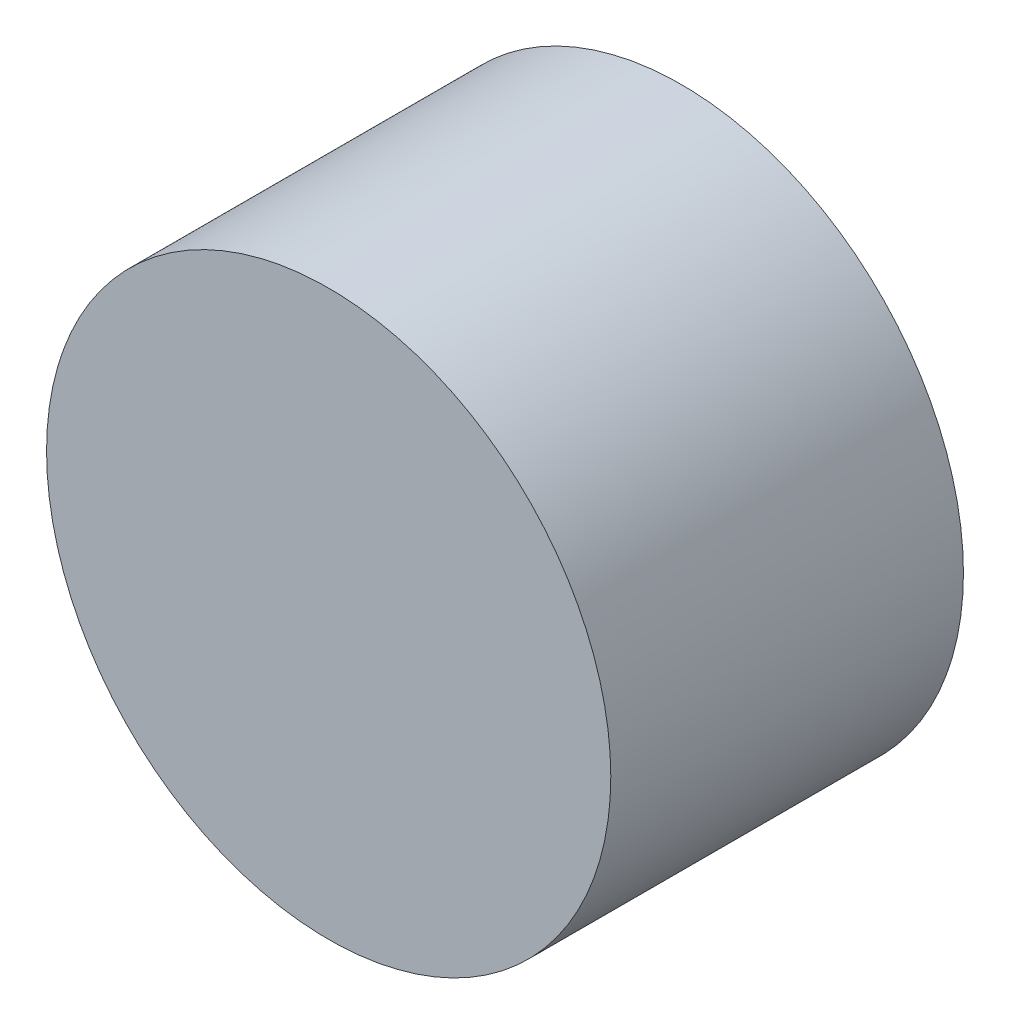
ISO-10303-21;
HEADER;
FILE_DESCRIPTION(('STEP AP214'),'2;1');
FILE_NAME('part.step','',(''),(''),'','','');
FILE_SCHEMA(('AUTOMOTIVE_DESIGN { 1 0 10303 214 1 1 1 1 }'));
ENDSEC;
DATA;
#1=APPLICATION_CONTEXT('core data for automotive mechanical design processes');
#2=APPLICATION_PROTOCOL_DEFINITION('international standard','automotive_design',2000,#1);
#3=PRODUCT_CONTEXT('',#1,'mechanical');
#4=PRODUCT('Part','Part','',(#3));
#5=PRODUCT_RELATED_PRODUCT_CATEGORY('part','',(#4));
#6=PRODUCT_DEFINITION_FORMATION('','',#4);
#7=PRODUCT_DEFINITION_CONTEXT('part definition',#1,'design');
#8=PRODUCT_DEFINITION('design','',#6,#7);
#9=PRODUCT_DEFINITION_SHAPE('','',#8);
#10=(LENGTH_UNIT() NAMED_UNIT(*) SI_UNIT(.MILLI.,.METRE.));
#11=(NAMED_UNIT(*) PLANE_ANGLE_UNIT() SI_UNIT($,.RADIAN.));
#12=(NAMED_UNIT(*) SI_UNIT($,.STERADIAN.) SOLID_ANGLE_UNIT());
#13=UNCERTAINTY_MEASURE_WITH_UNIT(LENGTH_MEASURE(1.E-05),#10,'distance_accuracy_value','');
#14=(GEOMETRIC_REPRESENTATION_CONTEXT(3) GLOBAL_UNCERTAINTY_ASSIGNED_CONTEXT((#13)) GLOBAL_UNIT_ASSIGNED_CONTEXT((#10,
#11,#12)) REPRESENTATION_CONTEXT('',''));
#15=CARTESIAN_POINT('',(0.,0.,0.));
#16=DIRECTION('',(0.,0.,1.));
#17=DIRECTION('',(1.,0.,0.));
#18=AXIS2_PLACEMENT_3D('',#15,#16,#17);
#19=CARTESIAN_POINT('',(0.,0.,2.5));
#20=DIRECTION('',(0.,0.,1.));
#21=DIRECTION('',(1.,0.,0.));
#22=AXIS2_PLACEMENT_3D('',#19,#20,#21);
#23=CYLINDRICAL_SURFACE('',#22,4.);
#24=CARTESIAN_POINT('',(0.,0.,5.));
#25=DIRECTION('',(0.,0.,1.));
#26=DIRECTION('',(1.,0.,0.));
#27=AXIS2_PLACEMENT_3D('',#24,#25,#26);
#28=CIRCLE('',#27,4.);
#29=CARTESIAN_POINT('',(4.,0.,5.));
#30=VERTEX_POINT('',#29);
#31=EDGE_CURVE('E9',#30,#30,#28,.T.);
#32=ORIENTED_EDGE('',*,*,#31,.F.);
#33=EDGE_LOOP('',(#32));
#34=FACE_BOUND('',#33,.T.);
#35=CARTESIAN_POINT('',(0.,0.,0.));
#36=DIRECTION('',(0.,0.,1.));
#37=DIRECTION('',(1.,0.,0.));
#38=AXIS2_PLACEMENT_3D('',#35,#36,#37);
#39=CIRCLE('',#38,4.);
#40=CARTESIAN_POINT('',(4.,0.,0.));
#41=VERTEX_POINT('',#40);
#42=EDGE_CURVE('E17',#41,#41,#39,.T.);
#43=ORIENTED_EDGE('',*,*,#42,.T.);
#44=EDGE_LOOP('',(#43));
#45=FACE_BOUND('',#44,.T.);
#46=ADVANCED_FACE('F13',(#34,#45),#23,.T.);
#47=CARTESIAN_POINT('',(0.,0.,0.));
#48=DIRECTION('',(0.,0.,1.));
#49=DIRECTION('',(1.,0.,0.));
#50=AXIS2_PLACEMENT_3D('',#47,#48,#49);
#51=PLANE('',#50);
#52=ORIENTED_EDGE('',*,*,#42,.F.);
#53=EDGE_LOOP('',(#52));
#54=FACE_BOUND('',#53,.T.);
#55=ADVANCED_FACE('F32',(#54),#51,.F.);
#56=CARTESIAN_POINT('',(0.,0.,5.));
#57=DIRECTION('',(0.,0.,1.));
#58=DIRECTION('',(1.,0.,0.));
#59=AXIS2_PLACEMENT_3D('',#56,#57,#58);
#60=PLANE('',#59);
#61=ORIENTED_EDGE('',*,*,#31,.T.);
#62=EDGE_LOOP('',(#61));
#63=FACE_BOUND('',#62,.T.);
#64=ADVANCED_FACE('F15',(#63),#60,.T.);
#65=CLOSED_SHELL('',(#46,#55,#64));
#66=MANIFOLD_SOLID_BREP('B1',#65);
#67=ADVANCED_BREP_SHAPE_REPRESENTATION('',(#18,#66),#14);
#68=SHAPE_DEFINITION_REPRESENTATION(#9,#67);
ENDSEC;
END-ISO-10303-21;
